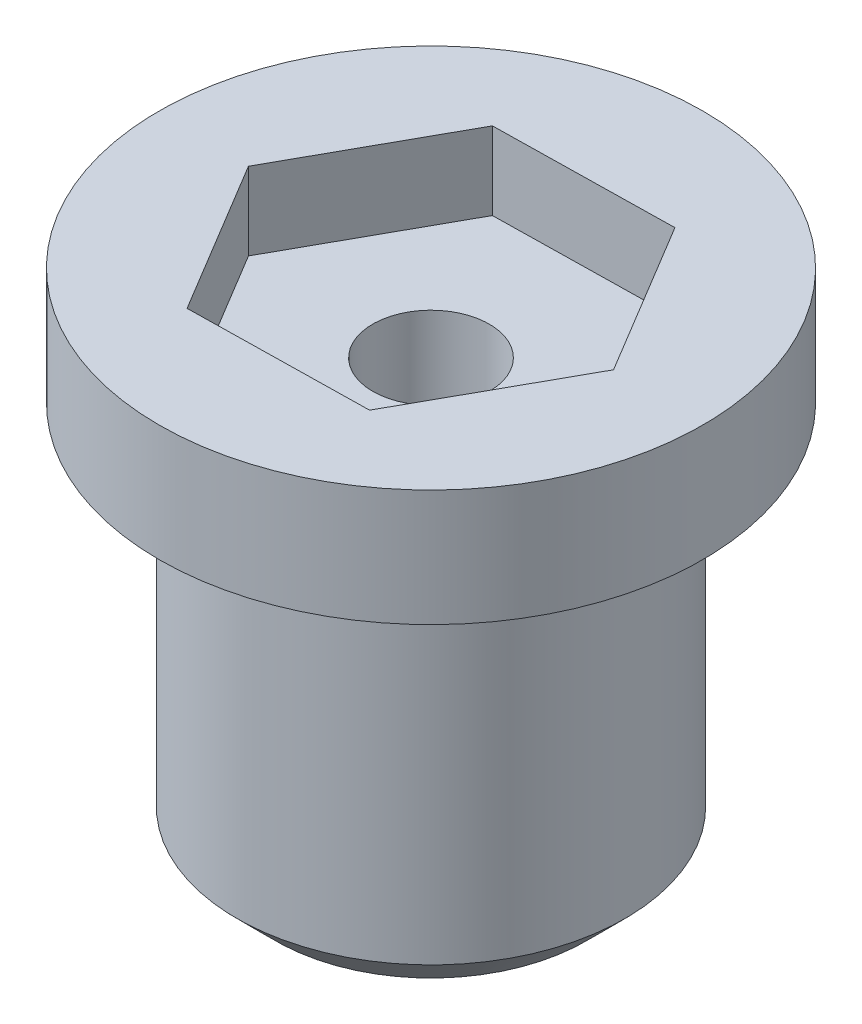
ISO-10303-21;
HEADER;
FILE_DESCRIPTION(('STEP AP214'),'2;1');
FILE_NAME('part.step','',(''),(''),'','','');
FILE_SCHEMA(('AUTOMOTIVE_DESIGN { 1 0 10303 214 1 1 1 1 }'));
ENDSEC;
DATA;
#1=APPLICATION_CONTEXT('core data for automotive mechanical design processes');
#2=APPLICATION_PROTOCOL_DEFINITION('international standard','automotive_design',2000,#1);
#3=PRODUCT_CONTEXT('',#1,'mechanical');
#4=PRODUCT('Part','Part','',(#3));
#5=PRODUCT_RELATED_PRODUCT_CATEGORY('part','',(#4));
#6=PRODUCT_DEFINITION_FORMATION('','',#4);
#7=PRODUCT_DEFINITION_CONTEXT('part definition',#1,'design');
#8=PRODUCT_DEFINITION('design','',#6,#7);
#9=PRODUCT_DEFINITION_SHAPE('','',#8);
#10=(LENGTH_UNIT() NAMED_UNIT(*) SI_UNIT(.MILLI.,.METRE.));
#11=(NAMED_UNIT(*) PLANE_ANGLE_UNIT() SI_UNIT($,.RADIAN.));
#12=(NAMED_UNIT(*) SI_UNIT($,.STERADIAN.) SOLID_ANGLE_UNIT());
#13=UNCERTAINTY_MEASURE_WITH_UNIT(LENGTH_MEASURE(1.E-05),#10,'distance_accuracy_value','');
#14=(GEOMETRIC_REPRESENTATION_CONTEXT(3) GLOBAL_UNCERTAINTY_ASSIGNED_CONTEXT((#13)) GLOBAL_UNIT_ASSIGNED_CONTEXT((#10,
#11,#12)) REPRESENTATION_CONTEXT('',''));
#15=CARTESIAN_POINT('',(0.,0.,0.));
#16=DIRECTION('',(0.,0.,1.));
#17=DIRECTION('',(1.,0.,0.));
#18=AXIS2_PLACEMENT_3D('',#15,#16,#17);
#19=CARTESIAN_POINT('',(0.,0.,0.));
#20=DIRECTION('',(0.,1.,0.));
#21=DIRECTION('',(0.,0.,1.));
#22=AXIS2_PLACEMENT_3D('',#19,#20,#21);
#23=CYLINDRICAL_SURFACE('',#22,1.5);
#24=CARTESIAN_POINT('',(0.,0.,0.));
#25=DIRECTION('',(0.,1.,0.));
#26=DIRECTION('',(0.,0.,1.));
#27=AXIS2_PLACEMENT_3D('',#24,#25,#26);
#28=CIRCLE('',#27,1.5);
#29=CARTESIAN_POINT('',(0.,0.,1.5));
#30=VERTEX_POINT('',#29);
#31=EDGE_CURVE('E143',#30,#30,#28,.T.);
#32=ORIENTED_EDGE('',*,*,#31,.F.);
#33=EDGE_LOOP('',(#32));
#34=FACE_BOUND('',#33,.T.);
#35=CARTESIAN_POINT('',(0.,11.,0.));
#36=DIRECTION('',(0.,1.,0.));
#37=DIRECTION('',(0.,0.,1.));
#38=AXIS2_PLACEMENT_3D('',#35,#36,#37);
#39=CIRCLE('',#38,1.5);
#40=CARTESIAN_POINT('',(0.,11.,1.5));
#41=VERTEX_POINT('',#40);
#42=EDGE_CURVE('E38',#41,#41,#39,.F.);
#43=ORIENTED_EDGE('',*,*,#42,.F.);
#44=EDGE_LOOP('',(#43));
#45=FACE_BOUND('',#44,.T.);
#46=ADVANCED_FACE('F34',(#34,#45),#23,.F.);
#47=CARTESIAN_POINT('',(0.,13.,0.));
#48=DIRECTION('',(0.,1.,0.));
#49=DIRECTION('',(0.,0.,1.));
#50=AXIS2_PLACEMENT_3D('',#47,#48,#49);
#51=PLANE('',#50);
#52=DIRECTION('',(-0.514975723325651,0.,-0.857204762227335));
#53=VECTOR('',#52,1.);
#54=CARTESIAN_POINT('',(4.61810453886209,13.,-0.0802732924122784));
#55=LINE('',#54,#53);
#56=CARTESIAN_POINT('',(4.61810453886209,13.,-0.0802732924122784));
#57=VERTEX_POINT('',#56);
#58=CARTESIAN_POINT('',(2.2395335589566,13.,-4.03953249419293));
#59=VERTEX_POINT('',#58);
#60=EDGE_CURVE('E50',#57,#59,#55,.T.);
#61=ORIENTED_EDGE('',*,*,#60,.F.);
#62=DIRECTION('',(0.484873238671047,0.,-0.874584439845948));
#63=VECTOR('',#62,1.);
#64=CARTESIAN_POINT('',(2.37857097990549,13.,3.95925920178065));
#65=LINE('',#64,#63);
#66=CARTESIAN_POINT('',(2.37857097990549,13.,3.95925920178065));
#67=VERTEX_POINT('',#66);
#68=EDGE_CURVE('E134',#67,#57,#65,.T.);
#69=ORIENTED_EDGE('',*,*,#68,.F.);
#70=DIRECTION('',(0.999848961996697,0.,-0.0173796776186122));
#71=VECTOR('',#70,1.);
#72=CARTESIAN_POINT('',(-2.23953355895659,13.,4.03953249419293));
#73=LINE('',#72,#71);
#74=CARTESIAN_POINT('',(-2.23953355895659,13.,4.03953249419293));
#75=VERTEX_POINT('',#74);
#76=EDGE_CURVE('E132',#75,#67,#73,.T.);
#77=ORIENTED_EDGE('',*,*,#76,.F.);
#78=DIRECTION('',(0.514975723325651,0.,0.857204762227335));
#79=VECTOR('',#78,1.);
#80=CARTESIAN_POINT('',(-4.61810453886209,13.,0.0802732924122794));
#81=LINE('',#80,#79);
#82=CARTESIAN_POINT('',(-4.61810453886209,13.,0.0802732924122794));
#83=VERTEX_POINT('',#82);
#84=EDGE_CURVE('E98',#83,#75,#81,.T.);
#85=ORIENTED_EDGE('',*,*,#84,.F.);
#86=DIRECTION('',(-0.484873238671046,0.,0.874584439845948));
#87=VECTOR('',#86,1.);
#88=CARTESIAN_POINT('',(-2.37857097990549,13.,-3.95925920178065));
#89=LINE('',#88,#87);
#90=CARTESIAN_POINT('',(-2.37857097990549,13.,-3.95925920178065));
#91=VERTEX_POINT('',#90);
#92=EDGE_CURVE('E128',#91,#83,#89,.T.);
#93=ORIENTED_EDGE('',*,*,#92,.F.);
#94=DIRECTION('',(-0.999848961996697,0.,0.017379677618612));
#95=VECTOR('',#94,1.);
#96=CARTESIAN_POINT('',(2.2395335589566,13.,-4.03953249419293));
#97=LINE('',#96,#95);
#98=EDGE_CURVE('E125',#59,#91,#97,.T.);
#99=ORIENTED_EDGE('',*,*,#98,.F.);
#100=EDGE_LOOP('',(#61,#69,#77,#85,#93,#99));
#101=FACE_BOUND('',#100,.T.);
#102=CARTESIAN_POINT('',(0.,13.,0.));
#103=DIRECTION('',(0.,-1.,0.));
#104=DIRECTION('',(0.,0.,-1.));
#105=AXIS2_PLACEMENT_3D('',#102,#103,#104);
#106=CIRCLE('',#105,7.);
#107=CARTESIAN_POINT('',(0.,13.,-7.));
#108=VERTEX_POINT('',#107);
#109=EDGE_CURVE('E146',#108,#108,#106,.T.);
#110=ORIENTED_EDGE('',*,*,#109,.F.);
#111=EDGE_LOOP('',(#110));
#112=FACE_BOUND('',#111,.T.);
#113=ADVANCED_FACE('F36',(#101,#112),#51,.T.);
#114=CARTESIAN_POINT('',(0.,0.,0.));
#115=DIRECTION('',(0.,-1.,0.));
#116=DIRECTION('',(0.,0.,-1.));
#117=AXIS2_PLACEMENT_3D('',#114,#115,#116);
#118=PLANE('',#117);
#119=ORIENTED_EDGE('',*,*,#31,.T.);
#120=EDGE_LOOP('',(#119));
#121=FACE_BOUND('',#120,.T.);
#122=CARTESIAN_POINT('',(0.,0.,0.));
#123=DIRECTION('',(0.,-1.,0.));
#124=DIRECTION('',(0.,0.,-1.));
#125=AXIS2_PLACEMENT_3D('',#122,#123,#124);
#126=CIRCLE('',#125,4.);
#127=CARTESIAN_POINT('',(0.,0.,-4.));
#128=VERTEX_POINT('',#127);
#129=EDGE_CURVE('E11',#128,#128,#126,.T.);
#130=ORIENTED_EDGE('',*,*,#129,.T.);
#131=EDGE_LOOP('',(#130));
#132=FACE_BOUND('',#131,.T.);
#133=ADVANCED_FACE('F173',(#121,#132),#118,.T.);
#134=CARTESIAN_POINT('',(0.,0.,0.));
#135=DIRECTION('',(0.,1.,0.));
#136=DIRECTION('',(0.,0.,1.));
#137=AXIS2_PLACEMENT_3D('',#134,#135,#136);
#138=CONICAL_SURFACE('',#137,4.,0.785398163397447);
#139=CARTESIAN_POINT('',(0.,1.,0.));
#140=DIRECTION('',(0.,-1.,0.));
#141=DIRECTION('',(0.,0.,-1.));
#142=AXIS2_PLACEMENT_3D('',#139,#140,#141);
#143=CIRCLE('',#142,5.);
#144=CARTESIAN_POINT('',(0.,1.,-5.));
#145=VERTEX_POINT('',#144);
#146=EDGE_CURVE('E43',#145,#145,#143,.T.);
#147=ORIENTED_EDGE('',*,*,#146,.T.);
#148=EDGE_LOOP('',(#147));
#149=FACE_BOUND('',#148,.T.);
#150=ORIENTED_EDGE('',*,*,#129,.F.);
#151=EDGE_LOOP('',(#150));
#152=FACE_BOUND('',#151,.T.);
#153=ADVANCED_FACE('F158',(#149,#152),#138,.T.);
#154=CARTESIAN_POINT('',(0.,-4.57066312709557,0.));
#155=DIRECTION('',(0.,-1.,0.));
#156=DIRECTION('',(0.,0.,-1.));
#157=AXIS2_PLACEMENT_3D('',#154,#155,#156);
#158=CYLINDRICAL_SURFACE('',#157,5.);
#159=CARTESIAN_POINT('',(0.,9.99999999999999,0.));
#160=DIRECTION('',(0.,-1.,0.));
#161=DIRECTION('',(0.,0.,-1.));
#162=AXIS2_PLACEMENT_3D('',#159,#160,#161);
#163=CIRCLE('',#162,5.);
#164=CARTESIAN_POINT('',(0.,9.99999999999999,-5.));
#165=VERTEX_POINT('',#164);
#166=EDGE_CURVE('E152',#165,#165,#163,.T.);
#167=ORIENTED_EDGE('',*,*,#166,.T.);
#168=EDGE_LOOP('',(#167));
#169=FACE_BOUND('',#168,.T.);
#170=ORIENTED_EDGE('',*,*,#146,.F.);
#171=EDGE_LOOP('',(#170));
#172=FACE_BOUND('',#171,.T.);
#173=ADVANCED_FACE('F161',(#169,#172),#158,.T.);
#174=CARTESIAN_POINT('',(0.,10.,0.));
#175=DIRECTION('',(0.,-1.,0.));
#176=DIRECTION('',(0.,0.,-1.));
#177=AXIS2_PLACEMENT_3D('',#174,#175,#176);
#178=PLANE('',#177);
#179=CARTESIAN_POINT('',(0.,10.,0.));
#180=DIRECTION('',(0.,-1.,0.));
#181=DIRECTION('',(0.,0.,-1.));
#182=AXIS2_PLACEMENT_3D('',#179,#180,#181);
#183=CIRCLE('',#182,7.);
#184=CARTESIAN_POINT('',(0.,10.,-7.));
#185=VERTEX_POINT('',#184);
#186=EDGE_CURVE('E149',#185,#185,#183,.T.);
#187=ORIENTED_EDGE('',*,*,#186,.T.);
#188=EDGE_LOOP('',(#187));
#189=FACE_BOUND('',#188,.T.);
#190=ORIENTED_EDGE('',*,*,#166,.F.);
#191=EDGE_LOOP('',(#190));
#192=FACE_BOUND('',#191,.T.);
#193=ADVANCED_FACE('F163',(#189,#192),#178,.T.);
#194=CARTESIAN_POINT('',(0.,-4.57066312709557,0.));
#195=DIRECTION('',(0.,-1.,0.));
#196=DIRECTION('',(0.,0.,-1.));
#197=AXIS2_PLACEMENT_3D('',#194,#195,#196);
#198=CYLINDRICAL_SURFACE('',#197,7.);
#199=ORIENTED_EDGE('',*,*,#109,.T.);
#200=EDGE_LOOP('',(#199));
#201=FACE_BOUND('',#200,.T.);
#202=ORIENTED_EDGE('',*,*,#186,.F.);
#203=EDGE_LOOP('',(#202));
#204=FACE_BOUND('',#203,.T.);
#205=ADVANCED_FACE('F170',(#201,#204),#198,.T.);
#206=CARTESIAN_POINT('',(0.,11.,0.));
#207=DIRECTION('',(0.,1.,0.));
#208=DIRECTION('',(0.,0.,1.));
#209=AXIS2_PLACEMENT_3D('',#206,#207,#208);
#210=PLANE('',#209);
#211=DIRECTION('',(-0.514975723325651,0.,-0.857204762227335));
#212=VECTOR('',#211,1.);
#213=CARTESIAN_POINT('',(4.61810453886209,11.,-0.0802732924122784));
#214=LINE('',#213,#212);
#215=CARTESIAN_POINT('',(4.61810453886209,11.,-0.0802732924122784));
#216=VERTEX_POINT('',#215);
#217=CARTESIAN_POINT('',(2.2395335589566,11.,-4.03953249419293));
#218=VERTEX_POINT('',#217);
#219=EDGE_CURVE('E136',#216,#218,#214,.T.);
#220=ORIENTED_EDGE('',*,*,#219,.T.);
#221=DIRECTION('',(-0.999848961996697,0.,0.017379677618612));
#222=VECTOR('',#221,1.);
#223=CARTESIAN_POINT('',(2.2395335589566,11.,-4.03953249419293));
#224=LINE('',#223,#222);
#225=CARTESIAN_POINT('',(-2.37857097990549,11.,-3.95925920178065));
#226=VERTEX_POINT('',#225);
#227=EDGE_CURVE('E119',#218,#226,#224,.T.);
#228=ORIENTED_EDGE('',*,*,#227,.T.);
#229=DIRECTION('',(-0.484873238671046,0.,0.874584439845948));
#230=VECTOR('',#229,1.);
#231=CARTESIAN_POINT('',(-2.37857097990549,11.,-3.95925920178065));
#232=LINE('',#231,#230);
#233=CARTESIAN_POINT('',(-4.61810453886209,11.,0.0802732924122794));
#234=VERTEX_POINT('',#233);
#235=EDGE_CURVE('E117',#226,#234,#232,.T.);
#236=ORIENTED_EDGE('',*,*,#235,.T.);
#237=DIRECTION('',(0.514975723325651,0.,0.857204762227335));
#238=VECTOR('',#237,1.);
#239=CARTESIAN_POINT('',(-4.61810453886209,11.,0.0802732924122794));
#240=LINE('',#239,#238);
#241=CARTESIAN_POINT('',(-2.23953355895659,11.,4.03953249419293));
#242=VERTEX_POINT('',#241);
#243=EDGE_CURVE('E95',#234,#242,#240,.T.);
#244=ORIENTED_EDGE('',*,*,#243,.T.);
#245=DIRECTION('',(0.999848961996697,0.,-0.0173796776186122));
#246=VECTOR('',#245,1.);
#247=CARTESIAN_POINT('',(-2.23953355895659,11.,4.03953249419293));
#248=LINE('',#247,#246);
#249=CARTESIAN_POINT('',(2.37857097990549,11.,3.95925920178065));
#250=VERTEX_POINT('',#249);
#251=EDGE_CURVE('E106',#242,#250,#248,.T.);
#252=ORIENTED_EDGE('',*,*,#251,.T.);
#253=DIRECTION('',(0.484873238671047,0.,-0.874584439845948));
#254=VECTOR('',#253,1.);
#255=CARTESIAN_POINT('',(2.37857097990549,11.,3.95925920178065));
#256=LINE('',#255,#254);
#257=EDGE_CURVE('E110',#250,#216,#256,.T.);
#258=ORIENTED_EDGE('',*,*,#257,.T.);
#259=EDGE_LOOP('',(#220,#228,#236,#244,#252,#258));
#260=FACE_BOUND('',#259,.T.);
#261=ORIENTED_EDGE('',*,*,#42,.T.);
#262=EDGE_LOOP('',(#261));
#263=FACE_BOUND('',#262,.T.);
#264=ADVANCED_FACE('F113',(#260,#263),#210,.T.);
#265=CARTESIAN_POINT('',(4.61810453886209,11.,-0.0802732924122784));
#266=DIRECTION('',(0.857204762227336,0.,-0.514975723325651));
#267=DIRECTION('',(-0.514975723325651,0.,-0.857204762227336));
#268=AXIS2_PLACEMENT_3D('',#265,#266,#267);
#269=PLANE('',#268);
#270=ORIENTED_EDGE('',*,*,#60,.T.);
#271=DIRECTION('',(0.,1.,0.));
#272=VECTOR('',#271,1.);
#273=CARTESIAN_POINT('',(2.2395335589566,11.,-4.03953249419293));
#274=LINE('',#273,#272);
#275=EDGE_CURVE('E80',#218,#59,#274,.T.);
#276=ORIENTED_EDGE('',*,*,#275,.F.);
#277=ORIENTED_EDGE('',*,*,#219,.F.);
#278=DIRECTION('',(0.,1.,0.));
#279=VECTOR('',#278,1.);
#280=CARTESIAN_POINT('',(4.61810453886209,11.,-0.0802732924122784));
#281=LINE('',#280,#279);
#282=EDGE_CURVE('E58',#216,#57,#281,.T.);
#283=ORIENTED_EDGE('',*,*,#282,.T.);
#284=EDGE_LOOP('',(#270,#276,#277,#283));
#285=FACE_BOUND('',#284,.T.);
#286=ADVANCED_FACE('F186',(#285),#269,.F.);
#287=CARTESIAN_POINT('',(2.37857097990549,11.,3.95925920178065));
#288=DIRECTION('',(0.874584439845948,0.,0.484873238671047));
#289=DIRECTION('',(0.484873238671047,0.,-0.874584439845948));
#290=AXIS2_PLACEMENT_3D('',#287,#288,#289);
#291=PLANE('',#290);
#292=ORIENTED_EDGE('',*,*,#68,.T.);
#293=ORIENTED_EDGE('',*,*,#282,.F.);
#294=ORIENTED_EDGE('',*,*,#257,.F.);
#295=DIRECTION('',(0.,1.,0.));
#296=VECTOR('',#295,1.);
#297=CARTESIAN_POINT('',(2.37857097990549,11.,3.95925920178065));
#298=LINE('',#297,#296);
#299=EDGE_CURVE('E102',#250,#67,#298,.T.);
#300=ORIENTED_EDGE('',*,*,#299,.T.);
#301=EDGE_LOOP('',(#292,#293,#294,#300));
#302=FACE_BOUND('',#301,.T.);
#303=ADVANCED_FACE('F203',(#302),#291,.F.);
#304=CARTESIAN_POINT('',(-2.23953355895659,11.,4.03953249419293));
#305=DIRECTION('',(0.0173796776186122,0.,0.999848961996697));
#306=DIRECTION('',(0.999848961996697,0.,-0.0173796776186122));
#307=AXIS2_PLACEMENT_3D('',#304,#305,#306);
#308=PLANE('',#307);
#309=ORIENTED_EDGE('',*,*,#76,.T.);
#310=ORIENTED_EDGE('',*,*,#299,.F.);
#311=ORIENTED_EDGE('',*,*,#251,.F.);
#312=DIRECTION('',(0.,1.,0.));
#313=VECTOR('',#312,1.);
#314=CARTESIAN_POINT('',(-2.23953355895659,11.,4.03953249419293));
#315=LINE('',#314,#313);
#316=EDGE_CURVE('E91',#242,#75,#315,.T.);
#317=ORIENTED_EDGE('',*,*,#316,.T.);
#318=EDGE_LOOP('',(#309,#310,#311,#317));
#319=FACE_BOUND('',#318,.T.);
#320=ADVANCED_FACE('F107',(#319),#308,.F.);
#321=CARTESIAN_POINT('',(-4.61810453886209,11.,0.0802732924122794));
#322=DIRECTION('',(-0.857204762227335,0.,0.514975723325651));
#323=DIRECTION('',(0.514975723325651,0.,0.857204762227335));
#324=AXIS2_PLACEMENT_3D('',#321,#322,#323);
#325=PLANE('',#324);
#326=ORIENTED_EDGE('',*,*,#84,.T.);
#327=ORIENTED_EDGE('',*,*,#316,.F.);
#328=ORIENTED_EDGE('',*,*,#243,.F.);
#329=DIRECTION('',(0.,1.,0.));
#330=VECTOR('',#329,1.);
#331=CARTESIAN_POINT('',(-4.61810453886209,11.,0.0802732924122794));
#332=LINE('',#331,#330);
#333=EDGE_CURVE('E103',#234,#83,#332,.T.);
#334=ORIENTED_EDGE('',*,*,#333,.T.);
#335=EDGE_LOOP('',(#326,#327,#328,#334));
#336=FACE_BOUND('',#335,.T.);
#337=ADVANCED_FACE('F93',(#336),#325,.F.);
#338=CARTESIAN_POINT('',(-2.37857097990549,11.,-3.95925920178065));
#339=DIRECTION('',(-0.874584439845948,0.,-0.484873238671046));
#340=DIRECTION('',(-0.484873238671047,0.,0.874584439845948));
#341=AXIS2_PLACEMENT_3D('',#338,#339,#340);
#342=PLANE('',#341);
#343=ORIENTED_EDGE('',*,*,#92,.T.);
#344=ORIENTED_EDGE('',*,*,#333,.F.);
#345=ORIENTED_EDGE('',*,*,#235,.F.);
#346=DIRECTION('',(0.,1.,0.));
#347=VECTOR('',#346,1.);
#348=CARTESIAN_POINT('',(-2.37857097990549,11.,-3.95925920178065));
#349=LINE('',#348,#347);
#350=EDGE_CURVE('E140',#226,#91,#349,.T.);
#351=ORIENTED_EDGE('',*,*,#350,.T.);
#352=EDGE_LOOP('',(#343,#344,#345,#351));
#353=FACE_BOUND('',#352,.T.);
#354=ADVANCED_FACE('F211',(#353),#342,.F.);
#355=CARTESIAN_POINT('',(2.2395335589566,11.,-4.03953249419293));
#356=DIRECTION('',(-0.017379677618612,0.,-0.999848961996697));
#357=DIRECTION('',(-0.999848961996697,0.,0.017379677618612));
#358=AXIS2_PLACEMENT_3D('',#355,#356,#357);
#359=PLANE('',#358);
#360=ORIENTED_EDGE('',*,*,#98,.T.);
#361=ORIENTED_EDGE('',*,*,#350,.F.);
#362=ORIENTED_EDGE('',*,*,#227,.F.);
#363=ORIENTED_EDGE('',*,*,#275,.T.);
#364=EDGE_LOOP('',(#360,#361,#362,#363));
#365=FACE_BOUND('',#364,.T.);
#366=ADVANCED_FACE('F213',(#365),#359,.F.);
#367=CLOSED_SHELL('',(#46,#113,#133,#153,#173,#193,#205,#264,#286,#303,#320,#337,#354,#366));
#368=MANIFOLD_SOLID_BREP('B2',#367);
#369=ADVANCED_BREP_SHAPE_REPRESENTATION('',(#18,#368),#14);
#370=SHAPE_DEFINITION_REPRESENTATION(#9,#369);
ENDSEC;
END-ISO-10303-21;
